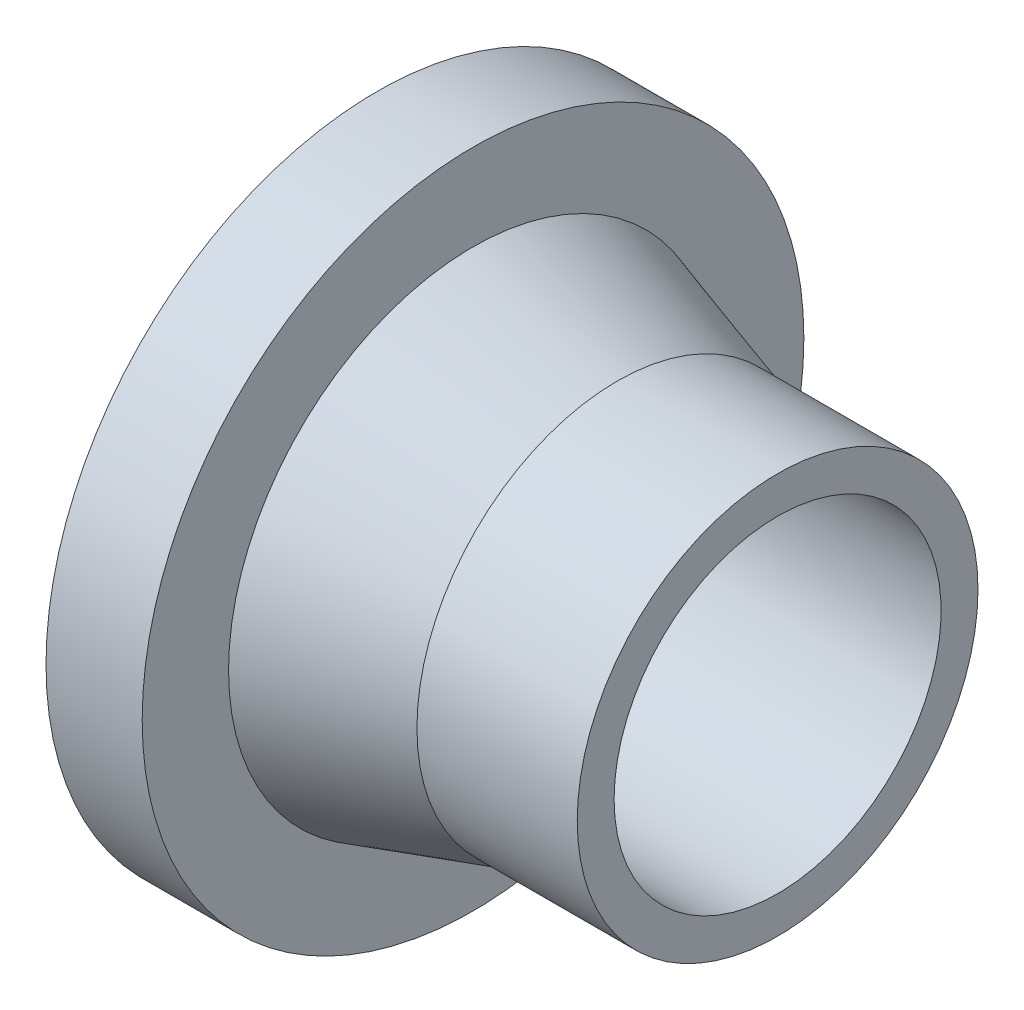
ISO-10303-21;
HEADER;
FILE_DESCRIPTION(('STEP AP214'),'2;1');
FILE_NAME('part.step','',(''),(''),'','','');
FILE_SCHEMA(('AUTOMOTIVE_DESIGN { 1 0 10303 214 1 1 1 1 }'));
ENDSEC;
DATA;
#1=APPLICATION_CONTEXT('core data for automotive mechanical design processes');
#2=APPLICATION_PROTOCOL_DEFINITION('international standard','automotive_design',2000,#1);
#3=PRODUCT_CONTEXT('',#1,'mechanical');
#4=PRODUCT('Part','Part','',(#3));
#5=PRODUCT_RELATED_PRODUCT_CATEGORY('part','',(#4));
#6=PRODUCT_DEFINITION_FORMATION('','',#4);
#7=PRODUCT_DEFINITION_CONTEXT('part definition',#1,'design');
#8=PRODUCT_DEFINITION('design','',#6,#7);
#9=PRODUCT_DEFINITION_SHAPE('','',#8);
#10=(LENGTH_UNIT() NAMED_UNIT(*) SI_UNIT(.MILLI.,.METRE.));
#11=(NAMED_UNIT(*) PLANE_ANGLE_UNIT() SI_UNIT($,.RADIAN.));
#12=(NAMED_UNIT(*) SI_UNIT($,.STERADIAN.) SOLID_ANGLE_UNIT());
#13=UNCERTAINTY_MEASURE_WITH_UNIT(LENGTH_MEASURE(1.E-05),#10,'distance_accuracy_value','');
#14=(GEOMETRIC_REPRESENTATION_CONTEXT(3) GLOBAL_UNCERTAINTY_ASSIGNED_CONTEXT((#13)) GLOBAL_UNIT_ASSIGNED_CONTEXT((#10,
#11,#12)) REPRESENTATION_CONTEXT('',''));
#15=CARTESIAN_POINT('',(0.,0.,0.));
#16=DIRECTION('',(0.,0.,1.));
#17=DIRECTION('',(1.,0.,0.));
#18=AXIS2_PLACEMENT_3D('',#15,#16,#17);
#19=CARTESIAN_POINT('',(-20.,0.,0.));
#20=DIRECTION('',(-1.,0.,0.));
#21=DIRECTION('',(0.,0.,1.));
#22=AXIS2_PLACEMENT_3D('',#19,#20,#21);
#23=CONICAL_SURFACE('',#22,25.,0.296545809069699);
#24=CARTESIAN_POINT('',(-38.,0.,0.));
#25=DIRECTION('',(-1.,0.,0.));
#26=DIRECTION('',(0.,0.,1.));
#27=AXIS2_PLACEMENT_3D('',#24,#25,#26);
#28=CIRCLE('',#27,30.5);
#29=CARTESIAN_POINT('',(-38.,0.,30.5));
#30=VERTEX_POINT('',#29);
#31=EDGE_CURVE('E16',#30,#30,#28,.T.);
#32=ORIENTED_EDGE('',*,*,#31,.F.);
#33=EDGE_LOOP('',(#32));
#34=FACE_BOUND('',#33,.T.);
#35=CARTESIAN_POINT('',(-20.,0.,0.));
#36=DIRECTION('',(-1.,0.,0.));
#37=DIRECTION('',(0.,1.,0.));
#38=AXIS2_PLACEMENT_3D('',#35,#36,#37);
#39=CIRCLE('',#38,25.);
#40=CARTESIAN_POINT('',(-20.,25.,0.));
#41=VERTEX_POINT('',#40);
#42=EDGE_CURVE('E28',#41,#41,#39,.F.);
#43=ORIENTED_EDGE('',*,*,#42,.F.);
#44=EDGE_LOOP('',(#43));
#45=FACE_BOUND('',#44,.T.);
#46=ADVANCED_FACE('F13',(#34,#45),#23,.T.);
#47=CARTESIAN_POINT('',(-38.,41.275,41.7703021083259));
#48=DIRECTION('',(1.,0.,0.));
#49=DIRECTION('',(0.,-1.,0.));
#50=AXIS2_PLACEMENT_3D('',#47,#48,#49);
#51=PLANE('',#50);
#52=ORIENTED_EDGE('',*,*,#31,.T.);
#53=EDGE_LOOP('',(#52));
#54=FACE_BOUND('',#53,.T.);
#55=CARTESIAN_POINT('',(-38.,0.,0.));
#56=DIRECTION('',(-1.,0.,0.));
#57=DIRECTION('',(0.,0.,1.));
#58=AXIS2_PLACEMENT_3D('',#55,#56,#57);
#59=CIRCLE('',#58,41.275);
#60=CARTESIAN_POINT('',(-38.,0.,41.275));
#61=VERTEX_POINT('',#60);
#62=EDGE_CURVE('E34',#61,#61,#59,.T.);
#63=ORIENTED_EDGE('',*,*,#62,.F.);
#64=EDGE_LOOP('',(#63));
#65=FACE_BOUND('',#64,.T.);
#66=ADVANCED_FACE('F44',(#54,#65),#51,.T.);
#67=CARTESIAN_POINT('',(-20.,0.,0.));
#68=DIRECTION('',(-1.,0.,0.));
#69=DIRECTION('',(0.,0.,1.));
#70=AXIS2_PLACEMENT_3D('',#67,#68,#69);
#71=CYLINDRICAL_SURFACE('',#70,25.);
#72=ORIENTED_EDGE('',*,*,#42,.T.);
#73=EDGE_LOOP('',(#72));
#74=FACE_BOUND('',#73,.T.);
#75=CARTESIAN_POINT('',(0.,0.,0.));
#76=DIRECTION('',(-1.,0.,0.));
#77=DIRECTION('',(0.,0.,1.));
#78=AXIS2_PLACEMENT_3D('',#75,#76,#77);
#79=CIRCLE('',#78,25.);
#80=CARTESIAN_POINT('',(0.,0.,25.));
#81=VERTEX_POINT('',#80);
#82=EDGE_CURVE('E32',#81,#81,#79,.F.);
#83=ORIENTED_EDGE('',*,*,#82,.F.);
#84=EDGE_LOOP('',(#83));
#85=FACE_BOUND('',#84,.T.);
#86=ADVANCED_FACE('F53',(#74,#85),#71,.T.);
#87=CARTESIAN_POINT('',(-50.,0.,0.));
#88=DIRECTION('',(-1.,0.,0.));
#89=DIRECTION('',(0.,0.,1.));
#90=AXIS2_PLACEMENT_3D('',#87,#88,#89);
#91=CYLINDRICAL_SURFACE('',#90,41.275);
#92=CARTESIAN_POINT('',(-50.,0.,0.));
#93=DIRECTION('',(-1.,0.,0.));
#94=DIRECTION('',(0.,0.,1.));
#95=AXIS2_PLACEMENT_3D('',#92,#93,#94);
#96=CIRCLE('',#95,41.275);
#97=CARTESIAN_POINT('',(-50.,0.,41.275));
#98=VERTEX_POINT('',#97);
#99=EDGE_CURVE('E25',#98,#98,#96,.T.);
#100=ORIENTED_EDGE('',*,*,#99,.F.);
#101=EDGE_LOOP('',(#100));
#102=FACE_BOUND('',#101,.T.);
#103=ORIENTED_EDGE('',*,*,#62,.T.);
#104=EDGE_LOOP('',(#103));
#105=FACE_BOUND('',#104,.T.);
#106=ADVANCED_FACE('F68',(#102,#105),#91,.T.);
#107=CARTESIAN_POINT('',(0.,25.,25.3000021083545));
#108=DIRECTION('',(1.,0.,0.));
#109=DIRECTION('',(0.,-1.,0.));
#110=AXIS2_PLACEMENT_3D('',#107,#108,#109);
#111=PLANE('',#110);
#112=CARTESIAN_POINT('',(0.,0.,0.));
#113=DIRECTION('',(-1.,0.,0.));
#114=DIRECTION('',(0.,0.,1.));
#115=AXIS2_PLACEMENT_3D('',#112,#113,#114);
#116=CIRCLE('',#115,20.4);
#117=CARTESIAN_POINT('',(0.,0.,20.4));
#118=VERTEX_POINT('',#117);
#119=EDGE_CURVE('E20',#118,#118,#116,.F.);
#120=ORIENTED_EDGE('',*,*,#119,.F.);
#121=EDGE_LOOP('',(#120));
#122=FACE_BOUND('',#121,.T.);
#123=ORIENTED_EDGE('',*,*,#82,.T.);
#124=EDGE_LOOP('',(#123));
#125=FACE_BOUND('',#124,.T.);
#126=ADVANCED_FACE('F62',(#122,#125),#111,.T.);
#127=CARTESIAN_POINT('',(-50.,-41.275,41.7703021083926));
#128=DIRECTION('',(-1.,0.,0.));
#129=DIRECTION('',(0.,1.,0.));
#130=AXIS2_PLACEMENT_3D('',#127,#128,#129);
#131=PLANE('',#130);
#132=CARTESIAN_POINT('',(-50.,0.,0.));
#133=DIRECTION('',(-1.,0.,0.));
#134=DIRECTION('',(0.,0.,1.));
#135=AXIS2_PLACEMENT_3D('',#132,#133,#134);
#136=CIRCLE('',#135,20.4);
#137=CARTESIAN_POINT('',(-50.,0.,20.4));
#138=VERTEX_POINT('',#137);
#139=EDGE_CURVE('E8',#138,#138,#136,.T.);
#140=ORIENTED_EDGE('',*,*,#139,.F.);
#141=EDGE_LOOP('',(#140));
#142=FACE_BOUND('',#141,.T.);
#143=ORIENTED_EDGE('',*,*,#99,.T.);
#144=EDGE_LOOP('',(#143));
#145=FACE_BOUND('',#144,.T.);
#146=ADVANCED_FACE('F56',(#142,#145),#131,.T.);
#147=CARTESIAN_POINT('',(0.,0.,0.));
#148=DIRECTION('',(-1.,0.,0.));
#149=DIRECTION('',(0.,0.,1.));
#150=AXIS2_PLACEMENT_3D('',#147,#148,#149);
#151=CYLINDRICAL_SURFACE('',#150,20.4);
#152=ORIENTED_EDGE('',*,*,#119,.T.);
#153=EDGE_LOOP('',(#152));
#154=FACE_BOUND('',#153,.T.);
#155=ORIENTED_EDGE('',*,*,#139,.T.);
#156=EDGE_LOOP('',(#155));
#157=FACE_BOUND('',#156,.T.);
#158=ADVANCED_FACE('F54',(#154,#157),#151,.F.);
#159=CLOSED_SHELL('',(#46,#66,#86,#106,#126,#146,#158));
#160=MANIFOLD_SOLID_BREP('B1',#159);
#161=ADVANCED_BREP_SHAPE_REPRESENTATION('',(#18,#160),#14);
#162=SHAPE_DEFINITION_REPRESENTATION(#9,#161);
ENDSEC;
END-ISO-10303-21;
